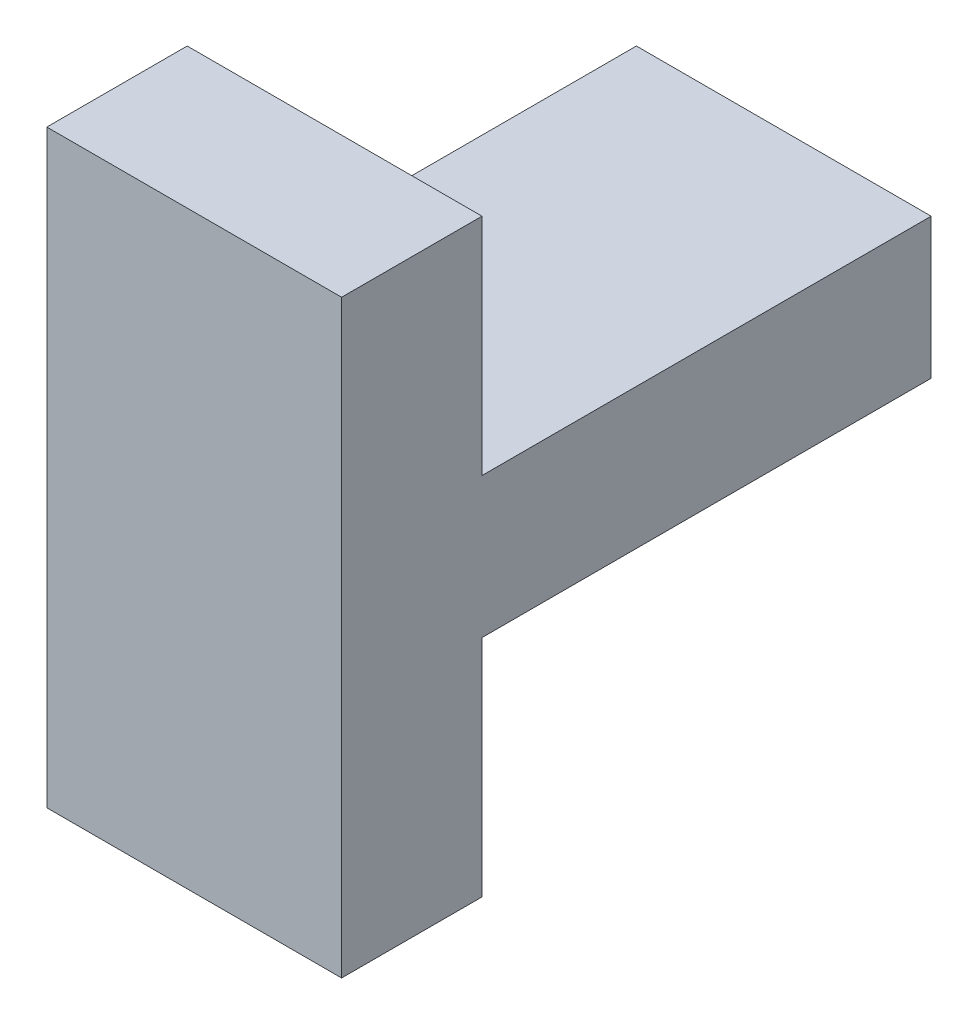
ISO-10303-21;
HEADER;
FILE_DESCRIPTION(('STEP AP214'),'2;1');
FILE_NAME('part.step','',(''),(''),'','','');
FILE_SCHEMA(('AUTOMOTIVE_DESIGN { 1 0 10303 214 1 1 1 1 }'));
ENDSEC;
DATA;
#1=APPLICATION_CONTEXT('core data for automotive mechanical design processes');
#2=APPLICATION_PROTOCOL_DEFINITION('international standard','automotive_design',2000,#1);
#3=PRODUCT_CONTEXT('',#1,'mechanical');
#4=PRODUCT('Part','Part','',(#3));
#5=PRODUCT_RELATED_PRODUCT_CATEGORY('part','',(#4));
#6=PRODUCT_DEFINITION_FORMATION('','',#4);
#7=PRODUCT_DEFINITION_CONTEXT('part definition',#1,'design');
#8=PRODUCT_DEFINITION('design','',#6,#7);
#9=PRODUCT_DEFINITION_SHAPE('','',#8);
#10=(LENGTH_UNIT() NAMED_UNIT(*) SI_UNIT(.MILLI.,.METRE.));
#11=(NAMED_UNIT(*) PLANE_ANGLE_UNIT() SI_UNIT($,.RADIAN.));
#12=(NAMED_UNIT(*) SI_UNIT($,.STERADIAN.) SOLID_ANGLE_UNIT());
#13=UNCERTAINTY_MEASURE_WITH_UNIT(LENGTH_MEASURE(1.E-05),#10,'distance_accuracy_value','');
#14=(GEOMETRIC_REPRESENTATION_CONTEXT(3) GLOBAL_UNCERTAINTY_ASSIGNED_CONTEXT((#13)) GLOBAL_UNIT_ASSIGNED_CONTEXT((#10,
#11,#12)) REPRESENTATION_CONTEXT('',''));
#15=CARTESIAN_POINT('',(0.,0.,0.));
#16=DIRECTION('',(0.,0.,1.));
#17=DIRECTION('',(1.,0.,0.));
#18=AXIS2_PLACEMENT_3D('',#15,#16,#17);
#19=CARTESIAN_POINT('',(21.,0.,32.));
#20=DIRECTION('',(0.,1.,0.));
#21=DIRECTION('',(0.,0.,1.));
#22=AXIS2_PLACEMENT_3D('',#19,#20,#21);
#23=PLANE('',#22);
#24=DIRECTION('',(0.,0.,-1.));
#25=VECTOR('',#24,1.);
#26=CARTESIAN_POINT('',(0.,0.,32.));
#27=LINE('',#26,#25);
#28=CARTESIAN_POINT('',(0.,0.,32.));
#29=VERTEX_POINT('',#28);
#30=CARTESIAN_POINT('',(0.,0.,0.));
#31=VERTEX_POINT('',#30);
#32=EDGE_CURVE('E139',#29,#31,#27,.T.);
#33=ORIENTED_EDGE('',*,*,#32,.T.);
#34=DIRECTION('',(-1.,0.,0.));
#35=VECTOR('',#34,1.);
#36=CARTESIAN_POINT('',(21.,0.,0.));
#37=LINE('',#36,#35);
#38=CARTESIAN_POINT('',(21.,0.,0.));
#39=VERTEX_POINT('',#38);
#40=EDGE_CURVE('E11',#39,#31,#37,.T.);
#41=ORIENTED_EDGE('',*,*,#40,.F.);
#42=DIRECTION('',(0.,0.,-1.));
#43=VECTOR('',#42,1.);
#44=CARTESIAN_POINT('',(21.,0.,32.));
#45=LINE('',#44,#43);
#46=CARTESIAN_POINT('',(21.,0.,32.));
#47=VERTEX_POINT('',#46);
#48=EDGE_CURVE('E153',#47,#39,#45,.T.);
#49=ORIENTED_EDGE('',*,*,#48,.F.);
#50=DIRECTION('',(-1.,0.,0.));
#51=VECTOR('',#50,1.);
#52=CARTESIAN_POINT('',(21.,0.,32.));
#53=LINE('',#52,#51);
#54=EDGE_CURVE('E135',#47,#29,#53,.T.);
#55=ORIENTED_EDGE('',*,*,#54,.T.);
#56=EDGE_LOOP('',(#33,#41,#49,#55));
#57=FACE_BOUND('',#56,.T.);
#58=ADVANCED_FACE('F43',(#57),#23,.F.);
#59=CARTESIAN_POINT('',(21.,0.,0.));
#60=DIRECTION('',(0.,0.,1.));
#61=DIRECTION('',(1.,0.,0.));
#62=AXIS2_PLACEMENT_3D('',#59,#60,#61);
#63=PLANE('',#62);
#64=DIRECTION('',(0.,1.,0.));
#65=VECTOR('',#64,1.);
#66=CARTESIAN_POINT('',(0.,0.,0.));
#67=LINE('',#66,#65);
#68=CARTESIAN_POINT('',(0.,10.,0.));
#69=VERTEX_POINT('',#68);
#70=EDGE_CURVE('E142',#31,#69,#67,.T.);
#71=ORIENTED_EDGE('',*,*,#70,.T.);
#72=DIRECTION('',(-1.,0.,0.));
#73=VECTOR('',#72,1.);
#74=CARTESIAN_POINT('',(21.,10.,0.));
#75=LINE('',#74,#73);
#76=CARTESIAN_POINT('',(21.,10.,0.));
#77=VERTEX_POINT('',#76);
#78=EDGE_CURVE('E51',#77,#69,#75,.T.);
#79=ORIENTED_EDGE('',*,*,#78,.F.);
#80=DIRECTION('',(0.,1.,0.));
#81=VECTOR('',#80,1.);
#82=CARTESIAN_POINT('',(21.,0.,0.));
#83=LINE('',#82,#81);
#84=EDGE_CURVE('E102',#39,#77,#83,.T.);
#85=ORIENTED_EDGE('',*,*,#84,.F.);
#86=ORIENTED_EDGE('',*,*,#40,.T.);
#87=EDGE_LOOP('',(#71,#79,#85,#86));
#88=FACE_BOUND('',#87,.T.);
#89=ADVANCED_FACE('F188',(#88),#63,.F.);
#90=CARTESIAN_POINT('',(21.,10.,0.));
#91=DIRECTION('',(0.,-1.,0.));
#92=DIRECTION('',(0.,0.,-1.));
#93=AXIS2_PLACEMENT_3D('',#90,#91,#92);
#94=PLANE('',#93);
#95=DIRECTION('',(0.,0.,1.));
#96=VECTOR('',#95,1.);
#97=CARTESIAN_POINT('',(0.,10.,0.));
#98=LINE('',#97,#96);
#99=CARTESIAN_POINT('',(0.,10.,32.));
#100=VERTEX_POINT('',#99);
#101=EDGE_CURVE('E144',#69,#100,#98,.T.);
#102=ORIENTED_EDGE('',*,*,#101,.T.);
#103=DIRECTION('',(-1.,0.,0.));
#104=VECTOR('',#103,1.);
#105=CARTESIAN_POINT('',(21.,10.,32.));
#106=LINE('',#105,#104);
#107=CARTESIAN_POINT('',(21.,10.,32.));
#108=VERTEX_POINT('',#107);
#109=EDGE_CURVE('E160',#108,#100,#106,.T.);
#110=ORIENTED_EDGE('',*,*,#109,.F.);
#111=DIRECTION('',(0.,0.,1.));
#112=VECTOR('',#111,1.);
#113=CARTESIAN_POINT('',(21.,10.,0.));
#114=LINE('',#113,#112);
#115=EDGE_CURVE('E168',#77,#108,#114,.T.);
#116=ORIENTED_EDGE('',*,*,#115,.F.);
#117=ORIENTED_EDGE('',*,*,#78,.T.);
#118=EDGE_LOOP('',(#102,#110,#116,#117));
#119=FACE_BOUND('',#118,.T.);
#120=ADVANCED_FACE('F166',(#119),#94,.F.);
#121=CARTESIAN_POINT('',(21.,10.,32.));
#122=DIRECTION('',(0.,0.,1.));
#123=DIRECTION('',(0.,-1.,0.));
#124=AXIS2_PLACEMENT_3D('',#121,#122,#123);
#125=PLANE('',#124);
#126=DIRECTION('',(0.,1.,0.));
#127=VECTOR('',#126,1.);
#128=CARTESIAN_POINT('',(0.,10.,32.));
#129=LINE('',#128,#127);
#130=CARTESIAN_POINT('',(0.,26.,32.));
#131=VERTEX_POINT('',#130);
#132=EDGE_CURVE('E146',#100,#131,#129,.T.);
#133=ORIENTED_EDGE('',*,*,#132,.T.);
#134=DIRECTION('',(-1.,0.,0.));
#135=VECTOR('',#134,1.);
#136=CARTESIAN_POINT('',(21.,26.,32.));
#137=LINE('',#136,#135);
#138=CARTESIAN_POINT('',(21.,26.,32.));
#139=VERTEX_POINT('',#138);
#140=EDGE_CURVE('E157',#139,#131,#137,.T.);
#141=ORIENTED_EDGE('',*,*,#140,.F.);
#142=DIRECTION('',(0.,1.,0.));
#143=VECTOR('',#142,1.);
#144=CARTESIAN_POINT('',(21.,10.,32.));
#145=LINE('',#144,#143);
#146=EDGE_CURVE('E180',#108,#139,#145,.T.);
#147=ORIENTED_EDGE('',*,*,#146,.F.);
#148=ORIENTED_EDGE('',*,*,#109,.T.);
#149=EDGE_LOOP('',(#133,#141,#147,#148));
#150=FACE_BOUND('',#149,.T.);
#151=ADVANCED_FACE('F176',(#150),#125,.F.);
#152=CARTESIAN_POINT('',(21.,26.,32.));
#153=DIRECTION('',(0.,-1.,0.));
#154=DIRECTION('',(0.,0.,-1.));
#155=AXIS2_PLACEMENT_3D('',#152,#153,#154);
#156=PLANE('',#155);
#157=DIRECTION('',(0.,0.,1.));
#158=VECTOR('',#157,1.);
#159=CARTESIAN_POINT('',(0.,26.,32.));
#160=LINE('',#159,#158);
#161=CARTESIAN_POINT('',(0.,26.,42.));
#162=VERTEX_POINT('',#161);
#163=EDGE_CURVE('E148',#131,#162,#160,.T.);
#164=ORIENTED_EDGE('',*,*,#163,.T.);
#165=DIRECTION('',(-1.,0.,0.));
#166=VECTOR('',#165,1.);
#167=CARTESIAN_POINT('',(21.,26.,42.));
#168=LINE('',#167,#166);
#169=CARTESIAN_POINT('',(21.,26.,42.));
#170=VERTEX_POINT('',#169);
#171=EDGE_CURVE('E130',#170,#162,#168,.T.);
#172=ORIENTED_EDGE('',*,*,#171,.F.);
#173=DIRECTION('',(0.,0.,1.));
#174=VECTOR('',#173,1.);
#175=CARTESIAN_POINT('',(21.,26.,32.));
#176=LINE('',#175,#174);
#177=EDGE_CURVE('E121',#139,#170,#176,.T.);
#178=ORIENTED_EDGE('',*,*,#177,.F.);
#179=ORIENTED_EDGE('',*,*,#140,.T.);
#180=EDGE_LOOP('',(#164,#172,#178,#179));
#181=FACE_BOUND('',#180,.T.);
#182=ADVANCED_FACE('F179',(#181),#156,.F.);
#183=CARTESIAN_POINT('',(21.,26.,42.));
#184=DIRECTION('',(0.,0.,-1.));
#185=DIRECTION('',(0.,1.,0.));
#186=AXIS2_PLACEMENT_3D('',#183,#184,#185);
#187=PLANE('',#186);
#188=DIRECTION('',(0.,-1.,0.));
#189=VECTOR('',#188,1.);
#190=CARTESIAN_POINT('',(0.,26.,42.));
#191=LINE('',#190,#189);
#192=CARTESIAN_POINT('',(0.,-16.,42.));
#193=VERTEX_POINT('',#192);
#194=EDGE_CURVE('E129',#162,#193,#191,.T.);
#195=ORIENTED_EDGE('',*,*,#194,.T.);
#196=DIRECTION('',(-1.,0.,0.));
#197=VECTOR('',#196,1.);
#198=CARTESIAN_POINT('',(21.,-16.,42.));
#199=LINE('',#198,#197);
#200=CARTESIAN_POINT('',(21.,-16.,42.));
#201=VERTEX_POINT('',#200);
#202=EDGE_CURVE('E126',#201,#193,#199,.T.);
#203=ORIENTED_EDGE('',*,*,#202,.F.);
#204=DIRECTION('',(0.,-1.,0.));
#205=VECTOR('',#204,1.);
#206=CARTESIAN_POINT('',(21.,26.,42.));
#207=LINE('',#206,#205);
#208=EDGE_CURVE('E115',#170,#201,#207,.T.);
#209=ORIENTED_EDGE('',*,*,#208,.F.);
#210=ORIENTED_EDGE('',*,*,#171,.T.);
#211=EDGE_LOOP('',(#195,#203,#209,#210));
#212=FACE_BOUND('',#211,.T.);
#213=ADVANCED_FACE('F127',(#212),#187,.F.);
#214=CARTESIAN_POINT('',(21.,-16.,42.));
#215=DIRECTION('',(0.,1.,0.));
#216=DIRECTION('',(0.,0.,1.));
#217=AXIS2_PLACEMENT_3D('',#214,#215,#216);
#218=PLANE('',#217);
#219=DIRECTION('',(0.,0.,-1.));
#220=VECTOR('',#219,1.);
#221=CARTESIAN_POINT('',(0.,-16.,42.));
#222=LINE('',#221,#220);
#223=CARTESIAN_POINT('',(0.,-16.,32.));
#224=VERTEX_POINT('',#223);
#225=EDGE_CURVE('E88',#193,#224,#222,.T.);
#226=ORIENTED_EDGE('',*,*,#225,.T.);
#227=DIRECTION('',(-1.,0.,0.));
#228=VECTOR('',#227,1.);
#229=CARTESIAN_POINT('',(21.,-16.,32.));
#230=LINE('',#229,#228);
#231=CARTESIAN_POINT('',(21.,-16.,32.));
#232=VERTEX_POINT('',#231);
#233=EDGE_CURVE('E131',#232,#224,#230,.T.);
#234=ORIENTED_EDGE('',*,*,#233,.F.);
#235=DIRECTION('',(0.,0.,-1.));
#236=VECTOR('',#235,1.);
#237=CARTESIAN_POINT('',(21.,-16.,42.));
#238=LINE('',#237,#236);
#239=EDGE_CURVE('E119',#201,#232,#238,.T.);
#240=ORIENTED_EDGE('',*,*,#239,.F.);
#241=ORIENTED_EDGE('',*,*,#202,.T.);
#242=EDGE_LOOP('',(#226,#234,#240,#241));
#243=FACE_BOUND('',#242,.T.);
#244=ADVANCED_FACE('F133',(#243),#218,.F.);
#245=CARTESIAN_POINT('',(21.,-16.,32.));
#246=DIRECTION('',(0.,0.,1.));
#247=DIRECTION('',(1.,0.,0.));
#248=AXIS2_PLACEMENT_3D('',#245,#246,#247);
#249=PLANE('',#248);
#250=DIRECTION('',(0.,1.,0.));
#251=VECTOR('',#250,1.);
#252=CARTESIAN_POINT('',(0.,-16.,32.));
#253=LINE('',#252,#251);
#254=EDGE_CURVE('E94',#224,#29,#253,.T.);
#255=ORIENTED_EDGE('',*,*,#254,.T.);
#256=ORIENTED_EDGE('',*,*,#54,.F.);
#257=DIRECTION('',(0.,1.,0.));
#258=VECTOR('',#257,1.);
#259=CARTESIAN_POINT('',(21.,-16.,32.));
#260=LINE('',#259,#258);
#261=EDGE_CURVE('E59',#232,#47,#260,.T.);
#262=ORIENTED_EDGE('',*,*,#261,.F.);
#263=ORIENTED_EDGE('',*,*,#233,.T.);
#264=EDGE_LOOP('',(#255,#256,#262,#263));
#265=FACE_BOUND('',#264,.T.);
#266=ADVANCED_FACE('F204',(#265),#249,.F.);
#267=CARTESIAN_POINT('',(21.,0.,0.));
#268=DIRECTION('',(1.,0.,0.));
#269=DIRECTION('',(0.,0.,-1.));
#270=AXIS2_PLACEMENT_3D('',#267,#268,#269);
#271=PLANE('',#270);
#272=ORIENTED_EDGE('',*,*,#48,.T.);
#273=ORIENTED_EDGE('',*,*,#84,.T.);
#274=ORIENTED_EDGE('',*,*,#115,.T.);
#275=ORIENTED_EDGE('',*,*,#146,.T.);
#276=ORIENTED_EDGE('',*,*,#177,.T.);
#277=ORIENTED_EDGE('',*,*,#208,.T.);
#278=ORIENTED_EDGE('',*,*,#239,.T.);
#279=ORIENTED_EDGE('',*,*,#261,.T.);
#280=EDGE_LOOP('',(#272,#273,#274,#275,#276,#277,#278,#279));
#281=FACE_BOUND('',#280,.T.);
#282=ADVANCED_FACE('F117',(#281),#271,.T.);
#283=CARTESIAN_POINT('',(0.,0.,0.));
#284=DIRECTION('',(1.,0.,0.));
#285=DIRECTION('',(0.,0.,-1.));
#286=AXIS2_PLACEMENT_3D('',#283,#284,#285);
#287=PLANE('',#286);
#288=ORIENTED_EDGE('',*,*,#32,.F.);
#289=ORIENTED_EDGE('',*,*,#254,.F.);
#290=ORIENTED_EDGE('',*,*,#225,.F.);
#291=ORIENTED_EDGE('',*,*,#194,.F.);
#292=ORIENTED_EDGE('',*,*,#163,.F.);
#293=ORIENTED_EDGE('',*,*,#132,.F.);
#294=ORIENTED_EDGE('',*,*,#101,.F.);
#295=ORIENTED_EDGE('',*,*,#70,.F.);
#296=EDGE_LOOP('',(#288,#289,#290,#291,#292,#293,#294,#295));
#297=FACE_BOUND('',#296,.T.);
#298=ADVANCED_FACE('F172',(#297),#287,.F.);
#299=CLOSED_SHELL('',(#58,#89,#120,#151,#182,#213,#244,#266,#282,#298));
#300=MANIFOLD_SOLID_BREP('B2',#299);
#301=ADVANCED_BREP_SHAPE_REPRESENTATION('',(#18,#300),#14);
#302=SHAPE_DEFINITION_REPRESENTATION(#9,#301);
ENDSEC;
END-ISO-10303-21;
